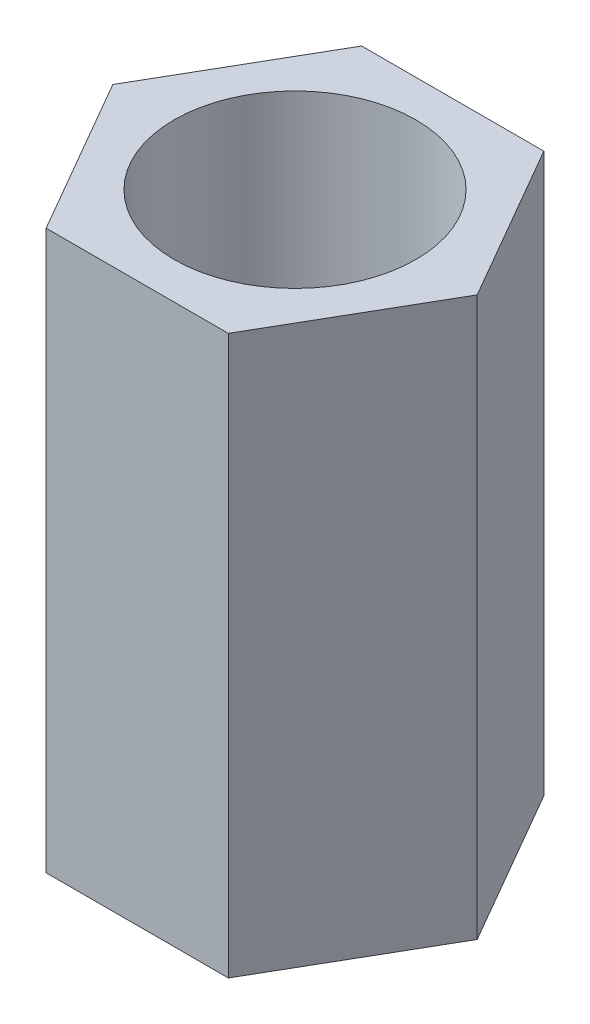
ISO-10303-21;
HEADER;
FILE_DESCRIPTION(('STEP AP214'),'2;1');
FILE_NAME('part.step','',(''),(''),'','','');
FILE_SCHEMA(('AUTOMOTIVE_DESIGN { 1 0 10303 214 1 1 1 1 }'));
ENDSEC;
DATA;
#1=APPLICATION_CONTEXT('core data for automotive mechanical design processes');
#2=APPLICATION_PROTOCOL_DEFINITION('international standard','automotive_design',2000,#1);
#3=PRODUCT_CONTEXT('',#1,'mechanical');
#4=PRODUCT('Part','Part','',(#3));
#5=PRODUCT_RELATED_PRODUCT_CATEGORY('part','',(#4));
#6=PRODUCT_DEFINITION_FORMATION('','',#4);
#7=PRODUCT_DEFINITION_CONTEXT('part definition',#1,'design');
#8=PRODUCT_DEFINITION('design','',#6,#7);
#9=PRODUCT_DEFINITION_SHAPE('','',#8);
#10=(LENGTH_UNIT() NAMED_UNIT(*) SI_UNIT(.MILLI.,.METRE.));
#11=(NAMED_UNIT(*) PLANE_ANGLE_UNIT() SI_UNIT($,.RADIAN.));
#12=(NAMED_UNIT(*) SI_UNIT($,.STERADIAN.) SOLID_ANGLE_UNIT());
#13=UNCERTAINTY_MEASURE_WITH_UNIT(LENGTH_MEASURE(1.E-05),#10,'distance_accuracy_value','');
#14=(GEOMETRIC_REPRESENTATION_CONTEXT(3) GLOBAL_UNCERTAINTY_ASSIGNED_CONTEXT((#13)) GLOBAL_UNIT_ASSIGNED_CONTEXT((#10,
#11,#12)) REPRESENTATION_CONTEXT('',''));
#15=CARTESIAN_POINT('',(0.,0.,0.));
#16=DIRECTION('',(0.,0.,1.));
#17=DIRECTION('',(1.,0.,0.));
#18=AXIS2_PLACEMENT_3D('',#15,#16,#17);
#19=CARTESIAN_POINT('',(0.,6.,0.));
#20=DIRECTION('',(0.,1.,0.));
#21=DIRECTION('',(0.,0.,1.));
#22=AXIS2_PLACEMENT_3D('',#19,#20,#21);
#23=PLANE('',#22);
#24=DIRECTION('',(1.,0.,0.));
#25=VECTOR('',#24,1.);
#26=CARTESIAN_POINT('',(-0.979018569486717,6.,1.6957099039044));
#27=LINE('',#26,#25);
#28=CARTESIAN_POINT('',(-0.979018569486717,6.,1.6957099039044));
#29=VERTEX_POINT('',#28);
#30=CARTESIAN_POINT('',(0.979018569486719,6.,1.6957099039044));
#31=VERTEX_POINT('',#30);
#32=EDGE_CURVE('E129',#29,#31,#27,.T.);
#33=ORIENTED_EDGE('',*,*,#32,.T.);
#34=DIRECTION('',(0.5,0.,-0.866025403784439));
#35=VECTOR('',#34,1.);
#36=CARTESIAN_POINT('',(0.979018569486719,6.,1.6957099039044));
#37=LINE('',#36,#35);
#38=CARTESIAN_POINT('',(1.95803713897344,6.,0.));
#39=VERTEX_POINT('',#38);
#40=EDGE_CURVE('E87',#31,#39,#37,.T.);
#41=ORIENTED_EDGE('',*,*,#40,.T.);
#42=DIRECTION('',(-0.5,0.,-0.866025403784438));
#43=VECTOR('',#42,1.);
#44=CARTESIAN_POINT('',(1.95803713897344,6.,0.));
#45=LINE('',#44,#43);
#46=CARTESIAN_POINT('',(0.979018569486718,6.,-1.6957099039044));
#47=VERTEX_POINT('',#46);
#48=EDGE_CURVE('E100',#39,#47,#45,.T.);
#49=ORIENTED_EDGE('',*,*,#48,.T.);
#50=DIRECTION('',(-1.,0.,0.));
#51=VECTOR('',#50,1.);
#52=CARTESIAN_POINT('',(0.979018569486718,6.,-1.6957099039044));
#53=LINE('',#52,#51);
#54=CARTESIAN_POINT('',(-0.979018569486718,6.,-1.6957099039044));
#55=VERTEX_POINT('',#54);
#56=EDGE_CURVE('E94',#47,#55,#53,.T.);
#57=ORIENTED_EDGE('',*,*,#56,.T.);
#58=DIRECTION('',(-0.5,0.,0.866025403784439));
#59=VECTOR('',#58,1.);
#60=CARTESIAN_POINT('',(-0.979018569486718,6.,-1.6957099039044));
#61=LINE('',#60,#59);
#62=CARTESIAN_POINT('',(-1.95803713897344,6.,0.));
#63=VERTEX_POINT('',#62);
#64=EDGE_CURVE('E98',#55,#63,#61,.T.);
#65=ORIENTED_EDGE('',*,*,#64,.T.);
#66=DIRECTION('',(0.5,0.,0.866025403784438));
#67=VECTOR('',#66,1.);
#68=CARTESIAN_POINT('',(-1.95803713897344,6.,0.));
#69=LINE('',#68,#67);
#70=EDGE_CURVE('E50',#63,#29,#69,.T.);
#71=ORIENTED_EDGE('',*,*,#70,.T.);
#72=EDGE_LOOP('',(#33,#41,#49,#57,#65,#71));
#73=FACE_BOUND('',#72,.T.);
#74=CARTESIAN_POINT('',(0.,6.,0.));
#75=DIRECTION('',(0.,1.,0.));
#76=DIRECTION('',(0.,0.,1.));
#77=AXIS2_PLACEMENT_3D('',#74,#75,#76);
#78=CIRCLE('',#77,1.3);
#79=CARTESIAN_POINT('',(0.,6.,1.3));
#80=VERTEX_POINT('',#79);
#81=EDGE_CURVE('E122',#80,#80,#78,.T.);
#82=ORIENTED_EDGE('',*,*,#81,.F.);
#83=EDGE_LOOP('',(#82));
#84=FACE_BOUND('',#83,.T.);
#85=ADVANCED_FACE('F33',(#73,#84),#23,.T.);
#86=CARTESIAN_POINT('',(0.,0.,0.));
#87=DIRECTION('',(0.,1.,0.));
#88=DIRECTION('',(0.,0.,1.));
#89=AXIS2_PLACEMENT_3D('',#86,#87,#88);
#90=PLANE('',#89);
#91=DIRECTION('',(1.,0.,0.));
#92=VECTOR('',#91,1.);
#93=CARTESIAN_POINT('',(-0.979018569486717,0.,1.6957099039044));
#94=LINE('',#93,#92);
#95=CARTESIAN_POINT('',(-0.979018569486717,0.,1.6957099039044));
#96=VERTEX_POINT('',#95);
#97=CARTESIAN_POINT('',(0.979018569486719,0.,1.6957099039044));
#98=VERTEX_POINT('',#97);
#99=EDGE_CURVE('E118',#96,#98,#94,.T.);
#100=ORIENTED_EDGE('',*,*,#99,.F.);
#101=DIRECTION('',(0.5,0.,0.866025403784438));
#102=VECTOR('',#101,1.);
#103=CARTESIAN_POINT('',(-1.95803713897344,0.,0.));
#104=LINE('',#103,#102);
#105=CARTESIAN_POINT('',(-1.95803713897344,0.,0.));
#106=VERTEX_POINT('',#105);
#107=EDGE_CURVE('E79',#106,#96,#104,.T.);
#108=ORIENTED_EDGE('',*,*,#107,.F.);
#109=DIRECTION('',(-0.5,0.,0.866025403784439));
#110=VECTOR('',#109,1.);
#111=CARTESIAN_POINT('',(-0.979018569486718,0.,-1.6957099039044));
#112=LINE('',#111,#110);
#113=CARTESIAN_POINT('',(-0.979018569486718,0.,-1.6957099039044));
#114=VERTEX_POINT('',#113);
#115=EDGE_CURVE('E73',#114,#106,#112,.T.);
#116=ORIENTED_EDGE('',*,*,#115,.F.);
#117=DIRECTION('',(-1.,0.,0.));
#118=VECTOR('',#117,1.);
#119=CARTESIAN_POINT('',(0.979018569486718,0.,-1.6957099039044));
#120=LINE('',#119,#118);
#121=CARTESIAN_POINT('',(0.979018569486718,0.,-1.6957099039044));
#122=VERTEX_POINT('',#121);
#123=EDGE_CURVE('E108',#122,#114,#120,.T.);
#124=ORIENTED_EDGE('',*,*,#123,.F.);
#125=DIRECTION('',(-0.5,0.,-0.866025403784438));
#126=VECTOR('',#125,1.);
#127=CARTESIAN_POINT('',(1.95803713897344,0.,0.));
#128=LINE('',#127,#126);
#129=CARTESIAN_POINT('',(1.95803713897344,0.,0.));
#130=VERTEX_POINT('',#129);
#131=EDGE_CURVE('E124',#130,#122,#128,.T.);
#132=ORIENTED_EDGE('',*,*,#131,.F.);
#133=DIRECTION('',(0.5,0.,-0.866025403784439));
#134=VECTOR('',#133,1.);
#135=CARTESIAN_POINT('',(0.979018569486719,0.,1.6957099039044));
#136=LINE('',#135,#134);
#137=EDGE_CURVE('E121',#98,#130,#136,.T.);
#138=ORIENTED_EDGE('',*,*,#137,.F.);
#139=EDGE_LOOP('',(#100,#108,#116,#124,#132,#138));
#140=FACE_BOUND('',#139,.T.);
#141=CARTESIAN_POINT('',(0.,0.,0.));
#142=DIRECTION('',(0.,1.,0.));
#143=DIRECTION('',(0.,0.,1.));
#144=AXIS2_PLACEMENT_3D('',#141,#142,#143);
#145=CIRCLE('',#144,1.3);
#146=CARTESIAN_POINT('',(0.,0.,1.3));
#147=VERTEX_POINT('',#146);
#148=EDGE_CURVE('E222',#147,#147,#145,.T.);
#149=ORIENTED_EDGE('',*,*,#148,.T.);
#150=EDGE_LOOP('',(#149));
#151=FACE_BOUND('',#150,.T.);
#152=ADVANCED_FACE('F138',(#140,#151),#90,.F.);
#153=CARTESIAN_POINT('',(-0.979018569486717,6.,1.6957099039044));
#154=DIRECTION('',(0.,0.,-1.));
#155=DIRECTION('',(-1.,0.,0.));
#156=AXIS2_PLACEMENT_3D('',#153,#154,#155);
#157=PLANE('',#156);
#158=ORIENTED_EDGE('',*,*,#99,.T.);
#159=DIRECTION('',(0.,-1.,0.));
#160=VECTOR('',#159,1.);
#161=CARTESIAN_POINT('',(0.979018569486719,6.,1.6957099039044));
#162=LINE('',#161,#160);
#163=EDGE_CURVE('E11',#31,#98,#162,.T.);
#164=ORIENTED_EDGE('',*,*,#163,.F.);
#165=ORIENTED_EDGE('',*,*,#32,.F.);
#166=DIRECTION('',(0.,-1.,0.));
#167=VECTOR('',#166,1.);
#168=CARTESIAN_POINT('',(-0.979018569486717,6.,1.6957099039044));
#169=LINE('',#168,#167);
#170=EDGE_CURVE('E114',#29,#96,#169,.T.);
#171=ORIENTED_EDGE('',*,*,#170,.T.);
#172=EDGE_LOOP('',(#158,#164,#165,#171));
#173=FACE_BOUND('',#172,.T.);
#174=ADVANCED_FACE('F35',(#173),#157,.F.);
#175=CARTESIAN_POINT('',(0.979018569486719,6.,1.6957099039044));
#176=DIRECTION('',(-0.866025403784439,0.,-0.5));
#177=DIRECTION('',(-0.5,0.,0.866025403784439));
#178=AXIS2_PLACEMENT_3D('',#175,#176,#177);
#179=PLANE('',#178);
#180=ORIENTED_EDGE('',*,*,#137,.T.);
#181=DIRECTION('',(0.,-1.,0.));
#182=VECTOR('',#181,1.);
#183=CARTESIAN_POINT('',(1.95803713897344,6.,0.));
#184=LINE('',#183,#182);
#185=EDGE_CURVE('E42',#39,#130,#184,.T.);
#186=ORIENTED_EDGE('',*,*,#185,.F.);
#187=ORIENTED_EDGE('',*,*,#40,.F.);
#188=ORIENTED_EDGE('',*,*,#163,.T.);
#189=EDGE_LOOP('',(#180,#186,#187,#188));
#190=FACE_BOUND('',#189,.T.);
#191=ADVANCED_FACE('F163',(#190),#179,.F.);
#192=CARTESIAN_POINT('',(1.95803713897344,6.,0.));
#193=DIRECTION('',(-0.866025403784439,0.,0.5));
#194=DIRECTION('',(0.5,0.,0.866025403784439));
#195=AXIS2_PLACEMENT_3D('',#192,#193,#194);
#196=PLANE('',#195);
#197=ORIENTED_EDGE('',*,*,#131,.T.);
#198=DIRECTION('',(0.,-1.,0.));
#199=VECTOR('',#198,1.);
#200=CARTESIAN_POINT('',(0.979018569486718,6.,-1.6957099039044));
#201=LINE('',#200,#199);
#202=EDGE_CURVE('E109',#47,#122,#201,.T.);
#203=ORIENTED_EDGE('',*,*,#202,.F.);
#204=ORIENTED_EDGE('',*,*,#48,.F.);
#205=ORIENTED_EDGE('',*,*,#185,.T.);
#206=EDGE_LOOP('',(#197,#203,#204,#205));
#207=FACE_BOUND('',#206,.T.);
#208=ADVANCED_FACE('F135',(#207),#196,.F.);
#209=CARTESIAN_POINT('',(0.979018569486718,6.,-1.6957099039044));
#210=DIRECTION('',(0.,0.,1.));
#211=DIRECTION('',(1.,0.,0.));
#212=AXIS2_PLACEMENT_3D('',#209,#210,#211);
#213=PLANE('',#212);
#214=ORIENTED_EDGE('',*,*,#123,.T.);
#215=DIRECTION('',(0.,-1.,0.));
#216=VECTOR('',#215,1.);
#217=CARTESIAN_POINT('',(-0.979018569486718,6.,-1.6957099039044));
#218=LINE('',#217,#216);
#219=EDGE_CURVE('E105',#55,#114,#218,.T.);
#220=ORIENTED_EDGE('',*,*,#219,.F.);
#221=ORIENTED_EDGE('',*,*,#56,.F.);
#222=ORIENTED_EDGE('',*,*,#202,.T.);
#223=EDGE_LOOP('',(#214,#220,#221,#222));
#224=FACE_BOUND('',#223,.T.);
#225=ADVANCED_FACE('F106',(#224),#213,.F.);
#226=CARTESIAN_POINT('',(-0.979018569486718,6.,-1.6957099039044));
#227=DIRECTION('',(0.866025403784439,0.,0.5));
#228=DIRECTION('',(0.5,0.,-0.866025403784439));
#229=AXIS2_PLACEMENT_3D('',#226,#227,#228);
#230=PLANE('',#229);
#231=ORIENTED_EDGE('',*,*,#115,.T.);
#232=DIRECTION('',(0.,-1.,0.));
#233=VECTOR('',#232,1.);
#234=CARTESIAN_POINT('',(-1.95803713897344,6.,0.));
#235=LINE('',#234,#233);
#236=EDGE_CURVE('E110',#63,#106,#235,.T.);
#237=ORIENTED_EDGE('',*,*,#236,.F.);
#238=ORIENTED_EDGE('',*,*,#64,.F.);
#239=ORIENTED_EDGE('',*,*,#219,.T.);
#240=EDGE_LOOP('',(#231,#237,#238,#239));
#241=FACE_BOUND('',#240,.T.);
#242=ADVANCED_FACE('F112',(#241),#230,.F.);
#243=CARTESIAN_POINT('',(-1.95803713897344,6.,0.));
#244=DIRECTION('',(0.866025403784438,0.,-0.5));
#245=DIRECTION('',(-0.5,0.,-0.866025403784438));
#246=AXIS2_PLACEMENT_3D('',#243,#244,#245);
#247=PLANE('',#246);
#248=ORIENTED_EDGE('',*,*,#107,.T.);
#249=ORIENTED_EDGE('',*,*,#170,.F.);
#250=ORIENTED_EDGE('',*,*,#70,.F.);
#251=ORIENTED_EDGE('',*,*,#236,.T.);
#252=EDGE_LOOP('',(#248,#249,#250,#251));
#253=FACE_BOUND('',#252,.T.);
#254=ADVANCED_FACE('F143',(#253),#247,.F.);
#255=CARTESIAN_POINT('',(0.,6.,0.));
#256=DIRECTION('',(0.,-1.,0.));
#257=DIRECTION('',(0.,0.,-1.));
#258=AXIS2_PLACEMENT_3D('',#255,#256,#257);
#259=CYLINDRICAL_SURFACE('',#258,1.3);
#260=ORIENTED_EDGE('',*,*,#81,.T.);
#261=EDGE_LOOP('',(#260));
#262=FACE_BOUND('',#261,.T.);
#263=ORIENTED_EDGE('',*,*,#148,.F.);
#264=EDGE_LOOP('',(#263));
#265=FACE_BOUND('',#264,.T.);
#266=ADVANCED_FACE('F145',(#262,#265),#259,.F.);
#267=CLOSED_SHELL('',(#85,#152,#174,#191,#208,#225,#242,#254,#266));
#268=MANIFOLD_SOLID_BREP('B2',#267);
#269=ADVANCED_BREP_SHAPE_REPRESENTATION('',(#18,#268),#14);
#270=SHAPE_DEFINITION_REPRESENTATION(#9,#269);
ENDSEC;
END-ISO-10303-21;
